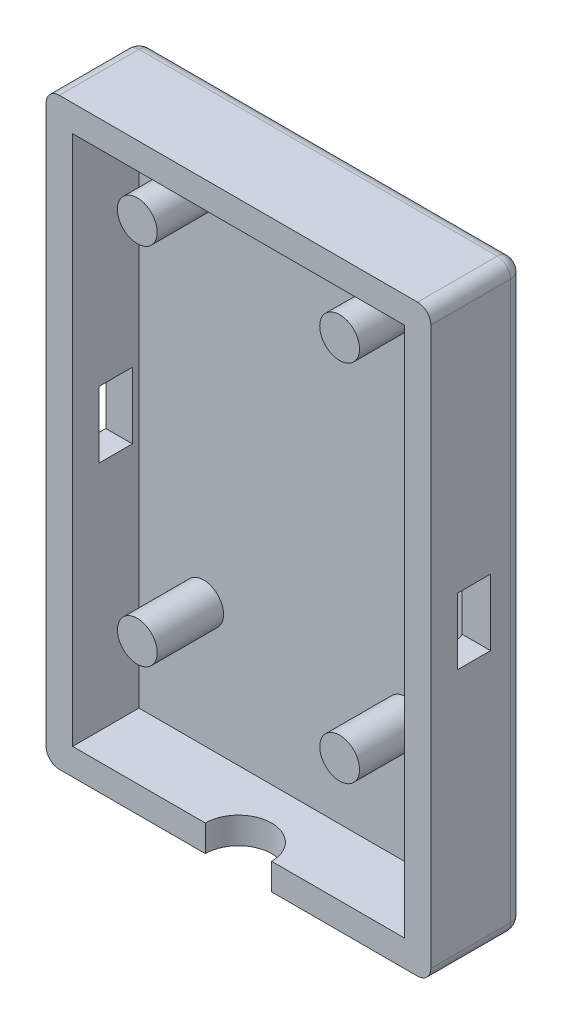
ISO-10303-21;
HEADER;
FILE_DESCRIPTION(('STEP AP214'),'2;1');
FILE_NAME('part.step','',(''),(''),'','','');
FILE_SCHEMA(('AUTOMOTIVE_DESIGN { 1 0 10303 214 1 1 1 1 }'));
ENDSEC;
DATA;
#1=APPLICATION_CONTEXT('core data for automotive mechanical design processes');
#2=APPLICATION_PROTOCOL_DEFINITION('international standard','automotive_design',2000,#1);
#3=PRODUCT_CONTEXT('',#1,'mechanical');
#4=PRODUCT('Part','Part','',(#3));
#5=PRODUCT_RELATED_PRODUCT_CATEGORY('part','',(#4));
#6=PRODUCT_DEFINITION_FORMATION('','',#4);
#7=PRODUCT_DEFINITION_CONTEXT('part definition',#1,'design');
#8=PRODUCT_DEFINITION('design','',#6,#7);
#9=PRODUCT_DEFINITION_SHAPE('','',#8);
#10=(LENGTH_UNIT() NAMED_UNIT(*) SI_UNIT(.MILLI.,.METRE.));
#11=(NAMED_UNIT(*) PLANE_ANGLE_UNIT() SI_UNIT($,.RADIAN.));
#12=(NAMED_UNIT(*) SI_UNIT($,.STERADIAN.) SOLID_ANGLE_UNIT());
#13=UNCERTAINTY_MEASURE_WITH_UNIT(LENGTH_MEASURE(1.E-05),#10,'distance_accuracy_value','');
#14=(GEOMETRIC_REPRESENTATION_CONTEXT(3) GLOBAL_UNCERTAINTY_ASSIGNED_CONTEXT((#13)) GLOBAL_UNIT_ASSIGNED_CONTEXT((#10,
#11,#12)) REPRESENTATION_CONTEXT('',''));
#15=CARTESIAN_POINT('',(0.,0.,0.));
#16=DIRECTION('',(0.,0.,1.));
#17=DIRECTION('',(1.,0.,0.));
#18=AXIS2_PLACEMENT_3D('',#15,#16,#17);
#19=CARTESIAN_POINT('',(14.5,25.025,2.));
#20=DIRECTION('',(-1.,0.,0.));
#21=DIRECTION('',(0.,-1.,0.));
#22=AXIS2_PLACEMENT_3D('',#19,#20,#21);
#23=PLANE('',#22);
#24=DIRECTION('',(0.,-1.,0.));
#25=VECTOR('',#24,1.);
#26=CARTESIAN_POINT('',(14.5,5.525,2.5));
#27=LINE('',#26,#25);
#28=CARTESIAN_POINT('',(14.5,5.525,2.5));
#29=VERTEX_POINT('',#28);
#30=CARTESIAN_POINT('',(14.5,0.525000000000001,2.5));
#31=VERTEX_POINT('',#30);
#32=EDGE_CURVE('E245',#29,#31,#27,.T.);
#33=ORIENTED_EDGE('',*,*,#32,.T.);
#34=DIRECTION('',(0.,0.,1.));
#35=VECTOR('',#34,1.);
#36=CARTESIAN_POINT('',(14.5,0.525000000000001,5.));
#37=LINE('',#36,#35);
#38=CARTESIAN_POINT('',(14.5,0.525000000000001,5.));
#39=VERTEX_POINT('',#38);
#40=EDGE_CURVE('E222',#31,#39,#37,.T.);
#41=ORIENTED_EDGE('',*,*,#40,.T.);
#42=DIRECTION('',(0.,1.,0.));
#43=VECTOR('',#42,1.);
#44=CARTESIAN_POINT('',(14.5,5.525,5.));
#45=LINE('',#44,#43);
#46=CARTESIAN_POINT('',(14.5,5.525,5.));
#47=VERTEX_POINT('',#46);
#48=EDGE_CURVE('E234',#39,#47,#45,.T.);
#49=ORIENTED_EDGE('',*,*,#48,.T.);
#50=DIRECTION('',(0.,0.,-1.));
#51=VECTOR('',#50,1.);
#52=CARTESIAN_POINT('',(14.5,5.525,4.5));
#53=LINE('',#52,#51);
#54=EDGE_CURVE('E241',#47,#29,#53,.T.);
#55=ORIENTED_EDGE('',*,*,#54,.T.);
#56=EDGE_LOOP('',(#33,#41,#49,#55));
#57=FACE_BOUND('',#56,.T.);
#58=DIRECTION('',(0.,1.,0.));
#59=VECTOR('',#58,1.);
#60=CARTESIAN_POINT('',(14.5,0.,7.));
#61=LINE('',#60,#59);
#62=CARTESIAN_POINT('',(14.5,-17.975,7.));
#63=VERTEX_POINT('',#62);
#64=CARTESIAN_POINT('',(14.5,24.025,7.));
#65=VERTEX_POINT('',#64);
#66=EDGE_CURVE('E306',#63,#65,#61,.T.);
#67=ORIENTED_EDGE('',*,*,#66,.F.);
#68=DIRECTION('',(0.,0.,-1.));
#69=VECTOR('',#68,1.);
#70=CARTESIAN_POINT('',(14.5,-17.975,2.));
#71=LINE('',#70,#69);
#72=CARTESIAN_POINT('',(14.5,-17.975,1.));
#73=VERTEX_POINT('',#72);
#74=EDGE_CURVE('E382',#63,#73,#71,.T.);
#75=ORIENTED_EDGE('',*,*,#74,.T.);
#76=DIRECTION('',(0.,1.,0.));
#77=VECTOR('',#76,1.);
#78=CARTESIAN_POINT('',(14.5,25.025,1.));
#79=LINE('',#78,#77);
#80=CARTESIAN_POINT('',(14.5,24.025,1.));
#81=VERTEX_POINT('',#80);
#82=EDGE_CURVE('E378',#73,#81,#79,.T.);
#83=ORIENTED_EDGE('',*,*,#82,.T.);
#84=DIRECTION('',(0.,0.,-1.));
#85=VECTOR('',#84,1.);
#86=CARTESIAN_POINT('',(14.5,24.025,2.));
#87=LINE('',#86,#85);
#88=EDGE_CURVE('E375',#81,#65,#87,.F.);
#89=ORIENTED_EDGE('',*,*,#88,.T.);
#90=EDGE_LOOP('',(#67,#75,#83,#89));
#91=FACE_BOUND('',#90,.T.);
#92=ADVANCED_FACE('F45',(#57,#91),#23,.F.);
#93=CARTESIAN_POINT('',(-14.5,25.025,2.));
#94=DIRECTION('',(0.,-1.,0.));
#95=DIRECTION('',(0.,0.,-1.));
#96=AXIS2_PLACEMENT_3D('',#93,#94,#95);
#97=PLANE('',#96);
#98=DIRECTION('',(-1.,0.,0.));
#99=VECTOR('',#98,1.);
#100=CARTESIAN_POINT('',(-14.5,25.025,1.));
#101=LINE('',#100,#99);
#102=CARTESIAN_POINT('',(13.5,25.025,1.));
#103=VERTEX_POINT('',#102);
#104=CARTESIAN_POINT('',(-13.5,25.025,1.));
#105=VERTEX_POINT('',#104);
#106=EDGE_CURVE('E428',#103,#105,#101,.T.);
#107=ORIENTED_EDGE('',*,*,#106,.T.);
#108=DIRECTION('',(0.,0.,-1.));
#109=VECTOR('',#108,1.);
#110=CARTESIAN_POINT('',(-13.5,25.025,2.));
#111=LINE('',#110,#109);
#112=CARTESIAN_POINT('',(-13.5,25.025,7.));
#113=VERTEX_POINT('',#112);
#114=EDGE_CURVE('E434',#105,#113,#111,.F.);
#115=ORIENTED_EDGE('',*,*,#114,.T.);
#116=DIRECTION('',(-1.,0.,0.));
#117=VECTOR('',#116,1.);
#118=CARTESIAN_POINT('',(0.,25.025,7.));
#119=LINE('',#118,#117);
#120=CARTESIAN_POINT('',(13.5,25.025,7.));
#121=VERTEX_POINT('',#120);
#122=EDGE_CURVE('E311',#121,#113,#119,.T.);
#123=ORIENTED_EDGE('',*,*,#122,.F.);
#124=DIRECTION('',(0.,0.,-1.));
#125=VECTOR('',#124,1.);
#126=CARTESIAN_POINT('',(13.5,25.025,2.));
#127=LINE('',#126,#125);
#128=EDGE_CURVE('E431',#121,#103,#127,.T.);
#129=ORIENTED_EDGE('',*,*,#128,.T.);
#130=EDGE_LOOP('',(#107,#115,#123,#129));
#131=FACE_BOUND('',#130,.T.);
#132=ADVANCED_FACE('F624',(#131),#97,.F.);
#133=CARTESIAN_POINT('',(-14.5,25.025,2.));
#134=DIRECTION('',(1.,0.,0.));
#135=DIRECTION('',(0.,1.,0.));
#136=AXIS2_PLACEMENT_3D('',#133,#134,#135);
#137=PLANE('',#136);
#138=DIRECTION('',(0.,1.,0.));
#139=VECTOR('',#138,1.);
#140=CARTESIAN_POINT('',(-14.5,5.525,5.));
#141=LINE('',#140,#139);
#142=CARTESIAN_POINT('',(-14.5,0.524999999999998,5.));
#143=VERTEX_POINT('',#142);
#144=CARTESIAN_POINT('',(-14.5,5.525,5.));
#145=VERTEX_POINT('',#144);
#146=EDGE_CURVE('E260',#143,#145,#141,.T.);
#147=ORIENTED_EDGE('',*,*,#146,.F.);
#148=DIRECTION('',(0.,0.,1.));
#149=VECTOR('',#148,1.);
#150=CARTESIAN_POINT('',(-14.5,0.524999999999998,4.5));
#151=LINE('',#150,#149);
#152=CARTESIAN_POINT('',(-14.5,0.524999999999997,2.5));
#153=VERTEX_POINT('',#152);
#154=EDGE_CURVE('E247',#153,#143,#151,.T.);
#155=ORIENTED_EDGE('',*,*,#154,.F.);
#156=DIRECTION('',(0.,-1.,0.));
#157=VECTOR('',#156,1.);
#158=CARTESIAN_POINT('',(-14.5,5.525,2.5));
#159=LINE('',#158,#157);
#160=CARTESIAN_POINT('',(-14.5,5.525,2.5));
#161=VERTEX_POINT('',#160);
#162=EDGE_CURVE('E250',#161,#153,#159,.T.);
#163=ORIENTED_EDGE('',*,*,#162,.F.);
#164=DIRECTION('',(0.,0.,-1.));
#165=VECTOR('',#164,1.);
#166=CARTESIAN_POINT('',(-14.5,5.525,4.5));
#167=LINE('',#166,#165);
#168=EDGE_CURVE('E264',#145,#161,#167,.T.);
#169=ORIENTED_EDGE('',*,*,#168,.F.);
#170=EDGE_LOOP('',(#147,#155,#163,#169));
#171=FACE_BOUND('',#170,.T.);
#172=DIRECTION('',(0.,-1.,0.));
#173=VECTOR('',#172,1.);
#174=CARTESIAN_POINT('',(-14.5,25.025,1.));
#175=LINE('',#174,#173);
#176=CARTESIAN_POINT('',(-14.5,24.025,1.));
#177=VERTEX_POINT('',#176);
#178=CARTESIAN_POINT('',(-14.5,-17.975,1.));
#179=VERTEX_POINT('',#178);
#180=EDGE_CURVE('E419',#177,#179,#175,.T.);
#181=ORIENTED_EDGE('',*,*,#180,.T.);
#182=DIRECTION('',(0.,0.,-1.));
#183=VECTOR('',#182,1.);
#184=CARTESIAN_POINT('',(-14.5,-17.975,2.));
#185=LINE('',#184,#183);
#186=CARTESIAN_POINT('',(-14.5,-17.975,7.));
#187=VERTEX_POINT('',#186);
#188=EDGE_CURVE('E425',#179,#187,#185,.F.);
#189=ORIENTED_EDGE('',*,*,#188,.T.);
#190=DIRECTION('',(0.,-1.,0.));
#191=VECTOR('',#190,1.);
#192=CARTESIAN_POINT('',(-14.5,0.,7.));
#193=LINE('',#192,#191);
#194=CARTESIAN_POINT('',(-14.5,24.025,7.));
#195=VERTEX_POINT('',#194);
#196=EDGE_CURVE('E315',#195,#187,#193,.T.);
#197=ORIENTED_EDGE('',*,*,#196,.F.);
#198=DIRECTION('',(0.,0.,-1.));
#199=VECTOR('',#198,1.);
#200=CARTESIAN_POINT('',(-14.5,24.025,2.));
#201=LINE('',#200,#199);
#202=EDGE_CURVE('E422',#195,#177,#201,.T.);
#203=ORIENTED_EDGE('',*,*,#202,.T.);
#204=EDGE_LOOP('',(#181,#189,#197,#203));
#205=FACE_BOUND('',#204,.T.);
#206=ADVANCED_FACE('F599',(#171,#205),#137,.F.);
#207=CARTESIAN_POINT('',(-14.5,-18.975,2.));
#208=DIRECTION('',(0.,1.,0.));
#209=DIRECTION('',(0.,0.,1.));
#210=AXIS2_PLACEMENT_3D('',#207,#208,#209);
#211=PLANE('',#210);
#212=DIRECTION('',(1.,0.,0.));
#213=VECTOR('',#212,1.);
#214=CARTESIAN_POINT('',(-14.5,-18.975,1.));
#215=LINE('',#214,#213);
#216=CARTESIAN_POINT('',(-13.5,-18.975,1.));
#217=VERTEX_POINT('',#216);
#218=CARTESIAN_POINT('',(13.5,-18.975,1.));
#219=VERTEX_POINT('',#218);
#220=EDGE_CURVE('E401',#217,#219,#215,.T.);
#221=ORIENTED_EDGE('',*,*,#220,.T.);
#222=DIRECTION('',(0.,0.,-1.));
#223=VECTOR('',#222,1.);
#224=CARTESIAN_POINT('',(13.5,-18.975,2.));
#225=LINE('',#224,#223);
#226=CARTESIAN_POINT('',(13.5,-18.975,7.));
#227=VERTEX_POINT('',#226);
#228=EDGE_CURVE('E404',#219,#227,#225,.F.);
#229=ORIENTED_EDGE('',*,*,#228,.T.);
#230=DIRECTION('',(1.,0.,0.));
#231=VECTOR('',#230,1.);
#232=CARTESIAN_POINT('',(0.,-18.975,7.));
#233=LINE('',#232,#231);
#234=CARTESIAN_POINT('',(2.5,-18.975,7.));
#235=VERTEX_POINT('',#234);
#236=EDGE_CURVE('E307',#235,#227,#233,.T.);
#237=ORIENTED_EDGE('',*,*,#236,.F.);
#238=CARTESIAN_POINT('',(0.,-18.975,7.));
#239=DIRECTION('',(0.,1.,0.));
#240=DIRECTION('',(0.,0.,1.));
#241=AXIS2_PLACEMENT_3D('',#238,#239,#240);
#242=CIRCLE('',#241,2.5);
#243=CARTESIAN_POINT('',(-2.5,-18.975,7.));
#244=VERTEX_POINT('',#243);
#245=EDGE_CURVE('E289',#235,#244,#242,.T.);
#246=ORIENTED_EDGE('',*,*,#245,.T.);
#247=CARTESIAN_POINT('',(-13.5,-18.975,7.));
#248=VERTEX_POINT('',#247);
#249=EDGE_CURVE('E303',#248,#244,#233,.T.);
#250=ORIENTED_EDGE('',*,*,#249,.F.);
#251=DIRECTION('',(0.,0.,-1.));
#252=VECTOR('',#251,1.);
#253=CARTESIAN_POINT('',(-13.5,-18.975,2.));
#254=LINE('',#253,#252);
#255=EDGE_CURVE('E398',#248,#217,#254,.T.);
#256=ORIENTED_EDGE('',*,*,#255,.T.);
#257=EDGE_LOOP('',(#221,#229,#237,#246,#250,#256));
#258=FACE_BOUND('',#257,.T.);
#259=ADVANCED_FACE('F579',(#258),#211,.F.);
#260=CARTESIAN_POINT('',(0.,0.,0.));
#261=DIRECTION('',(0.,0.,1.));
#262=DIRECTION('',(1.,0.,0.));
#263=AXIS2_PLACEMENT_3D('',#260,#261,#262);
#264=PLANE('',#263);
#265=DIRECTION('',(-1.,0.,0.));
#266=VECTOR('',#265,1.);
#267=CARTESIAN_POINT('',(0.,24.025,0.));
#268=LINE('',#267,#266);
#269=CARTESIAN_POINT('',(-13.5,24.025,0.));
#270=VERTEX_POINT('',#269);
#271=CARTESIAN_POINT('',(13.5,24.025,0.));
#272=VERTEX_POINT('',#271);
#273=EDGE_CURVE('E388',#270,#272,#268,.F.);
#274=ORIENTED_EDGE('',*,*,#273,.T.);
#275=DIRECTION('',(0.,1.,0.));
#276=VECTOR('',#275,1.);
#277=CARTESIAN_POINT('',(13.5,0.,0.));
#278=LINE('',#277,#276);
#279=CARTESIAN_POINT('',(13.5,-17.975,0.));
#280=VERTEX_POINT('',#279);
#281=EDGE_CURVE('E394',#272,#280,#278,.F.);
#282=ORIENTED_EDGE('',*,*,#281,.T.);
#283=DIRECTION('',(1.,0.,0.));
#284=VECTOR('',#283,1.);
#285=CARTESIAN_POINT('',(0.,-17.975,0.));
#286=LINE('',#285,#284);
#287=CARTESIAN_POINT('',(-13.5,-17.975,0.));
#288=VERTEX_POINT('',#287);
#289=EDGE_CURVE('E391',#280,#288,#286,.F.);
#290=ORIENTED_EDGE('',*,*,#289,.T.);
#291=DIRECTION('',(0.,-1.,0.));
#292=VECTOR('',#291,1.);
#293=CARTESIAN_POINT('',(-13.5,0.,0.));
#294=LINE('',#293,#292);
#295=EDGE_CURVE('E385',#288,#270,#294,.F.);
#296=ORIENTED_EDGE('',*,*,#295,.T.);
#297=EDGE_LOOP('',(#274,#282,#290,#296));
#298=FACE_BOUND('',#297,.T.);
#299=ADVANCED_FACE('F698',(#298),#264,.F.);
#300=CARTESIAN_POINT('',(0.,23.025,7.));
#301=DIRECTION('',(0.,1.,0.));
#302=DIRECTION('',(0.,0.,1.));
#303=AXIS2_PLACEMENT_3D('',#300,#301,#302);
#304=PLANE('',#303);
#305=DIRECTION('',(1.,0.,0.));
#306=VECTOR('',#305,1.);
#307=CARTESIAN_POINT('',(0.,23.025,2.));
#308=LINE('',#307,#306);
#309=CARTESIAN_POINT('',(-12.5,23.025,2.));
#310=VERTEX_POINT('',#309);
#311=CARTESIAN_POINT('',(11.5,23.025,2.));
#312=VERTEX_POINT('',#311);
#313=EDGE_CURVE('E299',#310,#312,#308,.T.);
#314=ORIENTED_EDGE('',*,*,#313,.T.);
#315=CARTESIAN_POINT('',(11.5,23.025,3.));
#316=DIRECTION('',(0.,1.,0.));
#317=DIRECTION('',(0.,0.,1.));
#318=AXIS2_PLACEMENT_3D('',#315,#316,#317);
#319=CIRCLE('',#318,1.);
#320=CARTESIAN_POINT('',(12.5,23.025,3.));
#321=VERTEX_POINT('',#320);
#322=EDGE_CURVE('E450',#312,#321,#319,.F.);
#323=ORIENTED_EDGE('',*,*,#322,.T.);
#324=DIRECTION('',(0.,0.,-1.));
#325=VECTOR('',#324,1.);
#326=CARTESIAN_POINT('',(12.5,23.025,7.));
#327=LINE('',#326,#325);
#328=CARTESIAN_POINT('',(12.5,23.025,7.));
#329=VERTEX_POINT('',#328);
#330=EDGE_CURVE('E358',#329,#321,#327,.T.);
#331=ORIENTED_EDGE('',*,*,#330,.F.);
#332=DIRECTION('',(1.,0.,0.));
#333=VECTOR('',#332,1.);
#334=CARTESIAN_POINT('',(0.,23.025,7.));
#335=LINE('',#334,#333);
#336=CARTESIAN_POINT('',(-12.5,23.025,7.));
#337=VERTEX_POINT('',#336);
#338=EDGE_CURVE('E319',#337,#329,#335,.T.);
#339=ORIENTED_EDGE('',*,*,#338,.F.);
#340=DIRECTION('',(0.,0.,-1.));
#341=VECTOR('',#340,1.);
#342=CARTESIAN_POINT('',(-12.5,23.025,7.));
#343=LINE('',#342,#341);
#344=EDGE_CURVE('E336',#337,#310,#343,.T.);
#345=ORIENTED_EDGE('',*,*,#344,.T.);
#346=EDGE_LOOP('',(#314,#323,#331,#339,#345));
#347=FACE_BOUND('',#346,.T.);
#348=ADVANCED_FACE('F558',(#347),#304,.F.);
#349=CARTESIAN_POINT('',(12.5,0.,7.));
#350=DIRECTION('',(1.,0.,0.));
#351=DIRECTION('',(0.,0.,-1.));
#352=AXIS2_PLACEMENT_3D('',#349,#350,#351);
#353=PLANE('',#352);
#354=ORIENTED_EDGE('',*,*,#330,.T.);
#355=DIRECTION('',(0.,-1.,0.));
#356=VECTOR('',#355,1.);
#357=CARTESIAN_POINT('',(12.5,0.,3.));
#358=LINE('',#357,#356);
#359=CARTESIAN_POINT('',(12.5,5.525,3.));
#360=VERTEX_POINT('',#359);
#361=EDGE_CURVE('E440',#321,#360,#358,.T.);
#362=ORIENTED_EDGE('',*,*,#361,.T.);
#363=DIRECTION('',(0.,0.,1.));
#364=VECTOR('',#363,1.);
#365=CARTESIAN_POINT('',(12.5,5.525,7.));
#366=LINE('',#365,#364);
#367=CARTESIAN_POINT('',(12.5,5.525,5.));
#368=VERTEX_POINT('',#367);
#369=EDGE_CURVE('E283',#360,#368,#366,.T.);
#370=ORIENTED_EDGE('',*,*,#369,.T.);
#371=DIRECTION('',(0.,-1.,0.));
#372=VECTOR('',#371,1.);
#373=CARTESIAN_POINT('',(12.5,0.,5.));
#374=LINE('',#373,#372);
#375=CARTESIAN_POINT('',(12.5,0.524999999999998,5.));
#376=VERTEX_POINT('',#375);
#377=EDGE_CURVE('E274',#368,#376,#374,.T.);
#378=ORIENTED_EDGE('',*,*,#377,.T.);
#379=DIRECTION('',(0.,0.,-1.));
#380=VECTOR('',#379,1.);
#381=CARTESIAN_POINT('',(12.5,0.525000000000001,7.));
#382=LINE('',#381,#380);
#383=CARTESIAN_POINT('',(12.5,0.525000000000001,3.));
#384=VERTEX_POINT('',#383);
#385=EDGE_CURVE('E224',#376,#384,#382,.T.);
#386=ORIENTED_EDGE('',*,*,#385,.T.);
#387=DIRECTION('',(0.,-1.,0.));
#388=VECTOR('',#387,1.);
#389=CARTESIAN_POINT('',(12.5,0.,3.));
#390=LINE('',#389,#388);
#391=CARTESIAN_POINT('',(12.5,-16.975,3.));
#392=VERTEX_POINT('',#391);
#393=EDGE_CURVE('E437',#384,#392,#390,.T.);
#394=ORIENTED_EDGE('',*,*,#393,.T.);
#395=DIRECTION('',(0.,0.,-1.));
#396=VECTOR('',#395,1.);
#397=CARTESIAN_POINT('',(12.5,-16.975,7.));
#398=LINE('',#397,#396);
#399=CARTESIAN_POINT('',(12.5,-16.975,7.));
#400=VERTEX_POINT('',#399);
#401=EDGE_CURVE('E354',#400,#392,#398,.T.);
#402=ORIENTED_EDGE('',*,*,#401,.F.);
#403=DIRECTION('',(0.,-1.,0.));
#404=VECTOR('',#403,1.);
#405=CARTESIAN_POINT('',(12.5,0.,7.));
#406=LINE('',#405,#404);
#407=EDGE_CURVE('E323',#329,#400,#406,.T.);
#408=ORIENTED_EDGE('',*,*,#407,.F.);
#409=EDGE_LOOP('',(#354,#362,#370,#378,#386,#394,#402,#408));
#410=FACE_BOUND('',#409,.T.);
#411=ADVANCED_FACE('F561',(#410),#353,.F.);
#412=CARTESIAN_POINT('',(0.,-16.975,7.));
#413=DIRECTION('',(0.,1.,0.));
#414=DIRECTION('',(-1.,0.,0.));
#415=AXIS2_PLACEMENT_3D('',#412,#413,#414);
#416=PLANE('',#415);
#417=ORIENTED_EDGE('',*,*,#401,.T.);
#418=CARTESIAN_POINT('',(11.5,-16.975,3.));
#419=DIRECTION('',(0.,1.,0.));
#420=DIRECTION('',(-1.,0.,0.));
#421=AXIS2_PLACEMENT_3D('',#418,#419,#420);
#422=CIRCLE('',#421,1.);
#423=CARTESIAN_POINT('',(11.5,-16.975,2.));
#424=VERTEX_POINT('',#423);
#425=EDGE_CURVE('E444',#392,#424,#422,.T.);
#426=ORIENTED_EDGE('',*,*,#425,.T.);
#427=DIRECTION('',(1.,0.,0.));
#428=VECTOR('',#427,1.);
#429=CARTESIAN_POINT('',(0.,-16.975,2.));
#430=LINE('',#429,#428);
#431=CARTESIAN_POINT('',(-12.5,-16.975,2.));
#432=VERTEX_POINT('',#431);
#433=EDGE_CURVE('E340',#432,#424,#430,.T.);
#434=ORIENTED_EDGE('',*,*,#433,.F.);
#435=DIRECTION('',(0.,0.,-1.));
#436=VECTOR('',#435,1.);
#437=CARTESIAN_POINT('',(-12.5,-16.975,7.));
#438=LINE('',#437,#436);
#439=CARTESIAN_POINT('',(-12.5,-16.975,7.));
#440=VERTEX_POINT('',#439);
#441=EDGE_CURVE('E350',#440,#432,#438,.T.);
#442=ORIENTED_EDGE('',*,*,#441,.F.);
#443=DIRECTION('',(1.,0.,0.));
#444=VECTOR('',#443,1.);
#445=CARTESIAN_POINT('',(0.,-16.975,7.));
#446=LINE('',#445,#444);
#447=CARTESIAN_POINT('',(-2.5,-16.975,7.));
#448=VERTEX_POINT('',#447);
#449=EDGE_CURVE('E328',#440,#448,#446,.T.);
#450=ORIENTED_EDGE('',*,*,#449,.T.);
#451=CARTESIAN_POINT('',(0.,-16.975,7.));
#452=DIRECTION('',(0.,1.,0.));
#453=DIRECTION('',(0.,0.,1.));
#454=AXIS2_PLACEMENT_3D('',#451,#452,#453);
#455=CIRCLE('',#454,2.5);
#456=CARTESIAN_POINT('',(2.5,-16.975,7.));
#457=VERTEX_POINT('',#456);
#458=EDGE_CURVE('E288',#457,#448,#455,.T.);
#459=ORIENTED_EDGE('',*,*,#458,.F.);
#460=EDGE_CURVE('E327',#457,#400,#446,.T.);
#461=ORIENTED_EDGE('',*,*,#460,.T.);
#462=EDGE_LOOP('',(#417,#426,#434,#442,#450,#459,#461));
#463=FACE_BOUND('',#462,.T.);
#464=ADVANCED_FACE('F571',(#463),#416,.T.);
#465=CARTESIAN_POINT('',(-12.5,0.,7.));
#466=DIRECTION('',(1.,0.,0.));
#467=DIRECTION('',(0.,1.,0.));
#468=AXIS2_PLACEMENT_3D('',#465,#466,#467);
#469=PLANE('',#468);
#470=DIRECTION('',(0.,0.,-1.));
#471=VECTOR('',#470,1.);
#472=CARTESIAN_POINT('',(-12.5,0.524999999999998,7.));
#473=LINE('',#472,#471);
#474=CARTESIAN_POINT('',(-12.5,0.524999999999998,5.));
#475=VERTEX_POINT('',#474);
#476=CARTESIAN_POINT('',(-12.5,0.524999999999998,2.5));
#477=VERTEX_POINT('',#476);
#478=EDGE_CURVE('E372',#475,#477,#473,.T.);
#479=ORIENTED_EDGE('',*,*,#478,.F.);
#480=DIRECTION('',(0.,-1.,0.));
#481=VECTOR('',#480,1.);
#482=CARTESIAN_POINT('',(-12.5,0.,5.));
#483=LINE('',#482,#481);
#484=CARTESIAN_POINT('',(-12.5,5.525,5.));
#485=VERTEX_POINT('',#484);
#486=EDGE_CURVE('E362',#485,#475,#483,.T.);
#487=ORIENTED_EDGE('',*,*,#486,.F.);
#488=DIRECTION('',(0.,0.,1.));
#489=VECTOR('',#488,1.);
#490=CARTESIAN_POINT('',(-12.5,5.525,7.));
#491=LINE('',#490,#489);
#492=CARTESIAN_POINT('',(-12.5,5.525,2.5));
#493=VERTEX_POINT('',#492);
#494=EDGE_CURVE('E365',#493,#485,#491,.T.);
#495=ORIENTED_EDGE('',*,*,#494,.F.);
#496=DIRECTION('',(0.,1.,0.));
#497=VECTOR('',#496,1.);
#498=CARTESIAN_POINT('',(-12.5,0.,2.5));
#499=LINE('',#498,#497);
#500=EDGE_CURVE('E369',#477,#493,#499,.T.);
#501=ORIENTED_EDGE('',*,*,#500,.F.);
#502=EDGE_LOOP('',(#479,#487,#495,#501));
#503=FACE_BOUND('',#502,.T.);
#504=DIRECTION('',(0.,-1.,0.));
#505=VECTOR('',#504,1.);
#506=CARTESIAN_POINT('',(-12.5,0.,2.));
#507=LINE('',#506,#505);
#508=EDGE_CURVE('E344',#310,#432,#507,.T.);
#509=ORIENTED_EDGE('',*,*,#508,.F.);
#510=ORIENTED_EDGE('',*,*,#344,.F.);
#511=DIRECTION('',(0.,-1.,0.));
#512=VECTOR('',#511,1.);
#513=CARTESIAN_POINT('',(-12.5,0.,7.));
#514=LINE('',#513,#512);
#515=EDGE_CURVE('E332',#337,#440,#514,.T.);
#516=ORIENTED_EDGE('',*,*,#515,.T.);
#517=ORIENTED_EDGE('',*,*,#441,.T.);
#518=EDGE_LOOP('',(#509,#510,#516,#517));
#519=FACE_BOUND('',#518,.T.);
#520=ADVANCED_FACE('F570',(#503,#519),#469,.T.);
#521=CARTESIAN_POINT('',(0.,0.,7.));
#522=DIRECTION('',(0.,0.,1.));
#523=DIRECTION('',(1.,0.,0.));
#524=AXIS2_PLACEMENT_3D('',#521,#522,#523);
#525=PLANE('',#524);
#526=ORIENTED_EDGE('',*,*,#236,.T.);
#527=CARTESIAN_POINT('',(13.5,-17.975,7.));
#528=DIRECTION('',(0.,0.,1.));
#529=DIRECTION('',(1.,0.,0.));
#530=AXIS2_PLACEMENT_3D('',#527,#528,#529);
#531=CIRCLE('',#530,1.);
#532=EDGE_CURVE('E416',#227,#63,#531,.T.);
#533=ORIENTED_EDGE('',*,*,#532,.T.);
#534=ORIENTED_EDGE('',*,*,#66,.T.);
#535=CARTESIAN_POINT('',(13.5,24.025,7.));
#536=DIRECTION('',(0.,0.,1.));
#537=DIRECTION('',(1.,0.,0.));
#538=AXIS2_PLACEMENT_3D('',#535,#536,#537);
#539=CIRCLE('',#538,1.);
#540=EDGE_CURVE('E407',#65,#121,#539,.T.);
#541=ORIENTED_EDGE('',*,*,#540,.T.);
#542=ORIENTED_EDGE('',*,*,#122,.T.);
#543=CARTESIAN_POINT('',(-13.5,24.025,7.));
#544=DIRECTION('',(0.,0.,1.));
#545=DIRECTION('',(1.,0.,0.));
#546=AXIS2_PLACEMENT_3D('',#543,#544,#545);
#547=CIRCLE('',#546,1.);
#548=EDGE_CURVE('E410',#113,#195,#547,.T.);
#549=ORIENTED_EDGE('',*,*,#548,.T.);
#550=ORIENTED_EDGE('',*,*,#196,.T.);
#551=CARTESIAN_POINT('',(-13.5,-17.975,7.));
#552=DIRECTION('',(0.,0.,1.));
#553=DIRECTION('',(1.,0.,0.));
#554=AXIS2_PLACEMENT_3D('',#551,#552,#553);
#555=CIRCLE('',#554,1.);
#556=EDGE_CURVE('E413',#187,#248,#555,.T.);
#557=ORIENTED_EDGE('',*,*,#556,.T.);
#558=ORIENTED_EDGE('',*,*,#249,.T.);
#559=DIRECTION('',(0.,1.,0.));
#560=VECTOR('',#559,1.);
#561=CARTESIAN_POINT('',(-2.5,-18.975,7.));
#562=LINE('',#561,#560);
#563=EDGE_CURVE('E293',#244,#448,#562,.T.);
#564=ORIENTED_EDGE('',*,*,#563,.T.);
#565=ORIENTED_EDGE('',*,*,#449,.F.);
#566=ORIENTED_EDGE('',*,*,#515,.F.);
#567=ORIENTED_EDGE('',*,*,#338,.T.);
#568=ORIENTED_EDGE('',*,*,#407,.T.);
#569=ORIENTED_EDGE('',*,*,#460,.F.);
#570=DIRECTION('',(0.,1.,0.));
#571=VECTOR('',#570,1.);
#572=CARTESIAN_POINT('',(2.5,-18.975,7.));
#573=LINE('',#572,#571);
#574=EDGE_CURVE('E296',#235,#457,#573,.T.);
#575=ORIENTED_EDGE('',*,*,#574,.F.);
#576=EDGE_LOOP('',(#526,#533,#534,#541,#542,#549,#550,#557,#558,#564,#565,#566,#567,#568,#569,#575));
#577=FACE_BOUND('',#576,.T.);
#578=ADVANCED_FACE('F544',(#577),#525,.T.);
#579=CARTESIAN_POINT('',(0.,0.,2.));
#580=DIRECTION('',(0.,0.,1.));
#581=DIRECTION('',(1.,0.,0.));
#582=AXIS2_PLACEMENT_3D('',#579,#580,#581);
#583=PLANE('',#582);
#584=CARTESIAN_POINT('',(7.625,19.775,2.));
#585=DIRECTION('',(0.,0.,1.));
#586=DIRECTION('',(-1.,0.,0.));
#587=AXIS2_PLACEMENT_3D('',#584,#585,#586);
#588=CIRCLE('',#587,1.5);
#589=CARTESIAN_POINT('',(6.125,19.775,2.));
#590=VERTEX_POINT('',#589);
#591=EDGE_CURVE('E507',#590,#590,#588,.T.);
#592=ORIENTED_EDGE('',*,*,#591,.F.);
#593=EDGE_LOOP('',(#592));
#594=FACE_BOUND('',#593,.T.);
#595=CARTESIAN_POINT('',(7.625,-7.675,2.));
#596=DIRECTION('',(0.,0.,1.));
#597=DIRECTION('',(1.,0.,0.));
#598=AXIS2_PLACEMENT_3D('',#595,#596,#597);
#599=CIRCLE('',#598,1.5);
#600=CARTESIAN_POINT('',(9.125,-7.675,2.));
#601=VERTEX_POINT('',#600);
#602=EDGE_CURVE('E516',#601,#601,#599,.T.);
#603=ORIENTED_EDGE('',*,*,#602,.F.);
#604=EDGE_LOOP('',(#603));
#605=FACE_BOUND('',#604,.T.);
#606=CARTESIAN_POINT('',(-7.625,-7.675,2.));
#607=DIRECTION('',(0.,0.,1.));
#608=DIRECTION('',(-1.,0.,0.));
#609=AXIS2_PLACEMENT_3D('',#606,#607,#608);
#610=CIRCLE('',#609,1.5);
#611=CARTESIAN_POINT('',(-9.125,-7.675,2.));
#612=VERTEX_POINT('',#611);
#613=EDGE_CURVE('E524',#612,#612,#610,.T.);
#614=ORIENTED_EDGE('',*,*,#613,.F.);
#615=EDGE_LOOP('',(#614));
#616=FACE_BOUND('',#615,.T.);
#617=CARTESIAN_POINT('',(-7.625,19.775,2.));
#618=DIRECTION('',(0.,0.,1.));
#619=DIRECTION('',(1.,0.,0.));
#620=AXIS2_PLACEMENT_3D('',#617,#618,#619);
#621=CIRCLE('',#620,1.5);
#622=CARTESIAN_POINT('',(-6.125,19.775,2.));
#623=VERTEX_POINT('',#622);
#624=EDGE_CURVE('E253',#623,#623,#621,.T.);
#625=ORIENTED_EDGE('',*,*,#624,.F.);
#626=EDGE_LOOP('',(#625));
#627=FACE_BOUND('',#626,.T.);
#628=ORIENTED_EDGE('',*,*,#433,.T.);
#629=DIRECTION('',(0.,-1.,0.));
#630=VECTOR('',#629,1.);
#631=CARTESIAN_POINT('',(11.5,0.,2.));
#632=LINE('',#631,#630);
#633=EDGE_CURVE('E447',#424,#312,#632,.F.);
#634=ORIENTED_EDGE('',*,*,#633,.T.);
#635=ORIENTED_EDGE('',*,*,#313,.F.);
#636=ORIENTED_EDGE('',*,*,#508,.T.);
#637=EDGE_LOOP('',(#628,#634,#635,#636));
#638=FACE_BOUND('',#637,.T.);
#639=ADVANCED_FACE('F540',(#594,#605,#616,#627,#638),#583,.T.);
#640=CARTESIAN_POINT('',(0.,-18.975,7.));
#641=DIRECTION('',(0.,1.,0.));
#642=DIRECTION('',(0.,0.,1.));
#643=AXIS2_PLACEMENT_3D('',#640,#641,#642);
#644=CYLINDRICAL_SURFACE('',#643,2.5);
#645=ORIENTED_EDGE('',*,*,#458,.T.);
#646=ORIENTED_EDGE('',*,*,#563,.F.);
#647=ORIENTED_EDGE('',*,*,#245,.F.);
#648=ORIENTED_EDGE('',*,*,#574,.T.);
#649=EDGE_LOOP('',(#645,#646,#647,#648));
#650=FACE_BOUND('',#649,.T.);
#651=ADVANCED_FACE('F543',(#650),#644,.F.);
#652=CARTESIAN_POINT('',(14.5,5.525,5.));
#653=DIRECTION('',(0.,0.,1.));
#654=DIRECTION('',(1.,0.,0.));
#655=AXIS2_PLACEMENT_3D('',#652,#653,#654);
#656=PLANE('',#655);
#657=ORIENTED_EDGE('',*,*,#486,.T.);
#658=DIRECTION('',(-1.,0.,0.));
#659=VECTOR('',#658,1.);
#660=CARTESIAN_POINT('',(14.5,0.525000000000001,5.));
#661=LINE('',#660,#659);
#662=EDGE_CURVE('E230',#475,#143,#661,.T.);
#663=ORIENTED_EDGE('',*,*,#662,.T.);
#664=ORIENTED_EDGE('',*,*,#146,.T.);
#665=DIRECTION('',(-1.,0.,0.));
#666=VECTOR('',#665,1.);
#667=CARTESIAN_POINT('',(14.5,5.525,5.));
#668=LINE('',#667,#666);
#669=EDGE_CURVE('E229',#485,#145,#668,.T.);
#670=ORIENTED_EDGE('',*,*,#669,.F.);
#671=EDGE_LOOP('',(#657,#663,#664,#670));
#672=FACE_BOUND('',#671,.T.);
#673=ADVANCED_FACE('F592',(#672),#656,.F.);
#674=CARTESIAN_POINT('',(14.5,5.525,4.5));
#675=DIRECTION('',(0.,1.,0.));
#676=DIRECTION('',(0.,0.,1.));
#677=AXIS2_PLACEMENT_3D('',#674,#675,#676);
#678=PLANE('',#677);
#679=ORIENTED_EDGE('',*,*,#494,.T.);
#680=ORIENTED_EDGE('',*,*,#669,.T.);
#681=ORIENTED_EDGE('',*,*,#168,.T.);
#682=DIRECTION('',(-1.,0.,0.));
#683=VECTOR('',#682,1.);
#684=CARTESIAN_POINT('',(14.5,5.525,2.5));
#685=LINE('',#684,#683);
#686=EDGE_CURVE('E278',#493,#161,#685,.T.);
#687=ORIENTED_EDGE('',*,*,#686,.F.);
#688=EDGE_LOOP('',(#679,#680,#681,#687));
#689=FACE_BOUND('',#688,.T.);
#690=ADVANCED_FACE('F604',(#689),#678,.F.);
#691=CARTESIAN_POINT('',(14.5,5.525,2.5));
#692=DIRECTION('',(0.,0.,-1.));
#693=DIRECTION('',(-1.,0.,0.));
#694=AXIS2_PLACEMENT_3D('',#691,#692,#693);
#695=PLANE('',#694);
#696=ORIENTED_EDGE('',*,*,#500,.T.);
#697=ORIENTED_EDGE('',*,*,#686,.T.);
#698=ORIENTED_EDGE('',*,*,#162,.T.);
#699=DIRECTION('',(-1.,0.,0.));
#700=VECTOR('',#699,1.);
#701=CARTESIAN_POINT('',(14.5,0.525000000000001,2.5));
#702=LINE('',#701,#700);
#703=EDGE_CURVE('E275',#477,#153,#702,.T.);
#704=ORIENTED_EDGE('',*,*,#703,.F.);
#705=EDGE_LOOP('',(#696,#697,#698,#704));
#706=FACE_BOUND('',#705,.T.);
#707=ADVANCED_FACE('F611',(#706),#695,.F.);
#708=CARTESIAN_POINT('',(14.5,0.525000000000001,4.5));
#709=DIRECTION('',(0.,-1.,0.));
#710=DIRECTION('',(1.,0.,0.));
#711=AXIS2_PLACEMENT_3D('',#708,#709,#710);
#712=PLANE('',#711);
#713=ORIENTED_EDGE('',*,*,#478,.T.);
#714=ORIENTED_EDGE('',*,*,#703,.T.);
#715=ORIENTED_EDGE('',*,*,#154,.T.);
#716=ORIENTED_EDGE('',*,*,#662,.F.);
#717=EDGE_LOOP('',(#713,#714,#715,#716));
#718=FACE_BOUND('',#717,.T.);
#719=ADVANCED_FACE('F609',(#718),#712,.F.);
#720=EDGE_CURVE('E218',#39,#376,#661,.T.);
#721=ORIENTED_EDGE('',*,*,#720,.F.);
#722=ORIENTED_EDGE('',*,*,#40,.F.);
#723=CARTESIAN_POINT('',(12.3660254037844,0.525000000000001,2.5));
#724=VERTEX_POINT('',#723);
#725=EDGE_CURVE('E62',#31,#724,#702,.T.);
#726=ORIENTED_EDGE('',*,*,#725,.T.);
#727=CARTESIAN_POINT('',(11.5,0.525000000000001,3.));
#728=DIRECTION('',(0.,-1.,0.));
#729=DIRECTION('',(1.,0.,0.));
#730=AXIS2_PLACEMENT_3D('',#727,#728,#729);
#731=CIRCLE('',#730,1.);
#732=EDGE_CURVE('E11',#724,#384,#731,.T.);
#733=ORIENTED_EDGE('',*,*,#732,.T.);
#734=ORIENTED_EDGE('',*,*,#385,.F.);
#735=EDGE_LOOP('',(#721,#722,#726,#733,#734));
#736=FACE_BOUND('',#735,.T.);
#737=ADVANCED_FACE('F220',(#736),#712,.F.);
#738=ORIENTED_EDGE('',*,*,#725,.F.);
#739=ORIENTED_EDGE('',*,*,#32,.F.);
#740=CARTESIAN_POINT('',(12.3660254037844,5.525,2.5));
#741=VERTEX_POINT('',#740);
#742=EDGE_CURVE('E69',#29,#741,#685,.T.);
#743=ORIENTED_EDGE('',*,*,#742,.T.);
#744=DIRECTION('',(0.,-1.,0.));
#745=VECTOR('',#744,1.);
#746=CARTESIAN_POINT('',(12.3660254037844,5.525,2.5));
#747=LINE('',#746,#745);
#748=EDGE_CURVE('E55',#741,#724,#747,.T.);
#749=ORIENTED_EDGE('',*,*,#748,.T.);
#750=EDGE_LOOP('',(#738,#739,#743,#749));
#751=FACE_BOUND('',#750,.T.);
#752=ADVANCED_FACE('F614',(#751),#695,.F.);
#753=ORIENTED_EDGE('',*,*,#742,.F.);
#754=ORIENTED_EDGE('',*,*,#54,.F.);
#755=EDGE_CURVE('E237',#47,#368,#668,.T.);
#756=ORIENTED_EDGE('',*,*,#755,.T.);
#757=ORIENTED_EDGE('',*,*,#369,.F.);
#758=CARTESIAN_POINT('',(11.5,5.525,3.));
#759=DIRECTION('',(0.,1.,0.));
#760=DIRECTION('',(0.,0.,1.));
#761=AXIS2_PLACEMENT_3D('',#758,#759,#760);
#762=CIRCLE('',#761,1.);
#763=EDGE_CURVE('E453',#360,#741,#762,.T.);
#764=ORIENTED_EDGE('',*,*,#763,.T.);
#765=EDGE_LOOP('',(#753,#754,#756,#757,#764));
#766=FACE_BOUND('',#765,.T.);
#767=ADVANCED_FACE('F621',(#766),#678,.F.);
#768=ORIENTED_EDGE('',*,*,#755,.F.);
#769=ORIENTED_EDGE('',*,*,#48,.F.);
#770=ORIENTED_EDGE('',*,*,#720,.T.);
#771=ORIENTED_EDGE('',*,*,#377,.F.);
#772=EDGE_LOOP('',(#768,#769,#770,#771));
#773=FACE_BOUND('',#772,.T.);
#774=ADVANCED_FACE('F235',(#773),#656,.F.);
#775=CARTESIAN_POINT('',(-7.625,19.775,7.));
#776=DIRECTION('',(0.,0.,-1.));
#777=DIRECTION('',(-1.,0.,0.));
#778=AXIS2_PLACEMENT_3D('',#775,#776,#777);
#779=CYLINDRICAL_SURFACE('',#778,1.5);
#780=CARTESIAN_POINT('',(-7.625,19.775,7.));
#781=DIRECTION('',(0.,0.,1.));
#782=DIRECTION('',(1.,0.,0.));
#783=AXIS2_PLACEMENT_3D('',#780,#781,#782);
#784=CIRCLE('',#783,1.5);
#785=CARTESIAN_POINT('',(-6.125,19.775,7.));
#786=VERTEX_POINT('',#785);
#787=EDGE_CURVE('E265',#786,#786,#784,.T.);
#788=ORIENTED_EDGE('',*,*,#787,.F.);
#789=EDGE_LOOP('',(#788));
#790=FACE_BOUND('',#789,.T.);
#791=ORIENTED_EDGE('',*,*,#624,.T.);
#792=EDGE_LOOP('',(#791));
#793=FACE_BOUND('',#792,.T.);
#794=ADVANCED_FACE('F538',(#790,#793),#779,.T.);
#795=CARTESIAN_POINT('',(-7.625,19.775,7.));
#796=DIRECTION('',(0.,0.,1.));
#797=DIRECTION('',(1.,0.,0.));
#798=AXIS2_PLACEMENT_3D('',#795,#796,#797);
#799=PLANE('',#798);
#800=ORIENTED_EDGE('',*,*,#787,.T.);
#801=EDGE_LOOP('',(#800));
#802=FACE_BOUND('',#801,.T.);
#803=ADVANCED_FACE('F840',(#802),#799,.T.);
#804=CARTESIAN_POINT('',(-7.625,-7.675,7.));
#805=DIRECTION('',(0.,0.,-1.));
#806=DIRECTION('',(-1.,0.,0.));
#807=AXIS2_PLACEMENT_3D('',#804,#805,#806);
#808=CYLINDRICAL_SURFACE('',#807,1.5);
#809=CARTESIAN_POINT('',(-7.625,-7.675,7.));
#810=DIRECTION('',(0.,0.,1.));
#811=DIRECTION('',(-1.,0.,0.));
#812=AXIS2_PLACEMENT_3D('',#809,#810,#811);
#813=CIRCLE('',#812,1.5);
#814=CARTESIAN_POINT('',(-9.125,-7.675,7.));
#815=VERTEX_POINT('',#814);
#816=EDGE_CURVE('E520',#815,#815,#813,.T.);
#817=ORIENTED_EDGE('',*,*,#816,.F.);
#818=EDGE_LOOP('',(#817));
#819=FACE_BOUND('',#818,.T.);
#820=ORIENTED_EDGE('',*,*,#613,.T.);
#821=EDGE_LOOP('',(#820));
#822=FACE_BOUND('',#821,.T.);
#823=ADVANCED_FACE('F851',(#819,#822),#808,.T.);
#824=CARTESIAN_POINT('',(-7.625,-7.675,7.));
#825=DIRECTION('',(0.,0.,-1.));
#826=DIRECTION('',(-1.,0.,0.));
#827=AXIS2_PLACEMENT_3D('',#824,#825,#826);
#828=PLANE('',#827);
#829=ORIENTED_EDGE('',*,*,#816,.T.);
#830=EDGE_LOOP('',(#829));
#831=FACE_BOUND('',#830,.T.);
#832=ADVANCED_FACE('F861',(#831),#828,.F.);
#833=CARTESIAN_POINT('',(7.625,-7.675,7.));
#834=DIRECTION('',(0.,0.,-1.));
#835=DIRECTION('',(-1.,0.,0.));
#836=AXIS2_PLACEMENT_3D('',#833,#834,#835);
#837=CYLINDRICAL_SURFACE('',#836,1.5);
#838=CARTESIAN_POINT('',(7.625,-7.675,7.));
#839=DIRECTION('',(0.,0.,1.));
#840=DIRECTION('',(1.,0.,0.));
#841=AXIS2_PLACEMENT_3D('',#838,#839,#840);
#842=CIRCLE('',#841,1.5);
#843=CARTESIAN_POINT('',(9.125,-7.675,7.));
#844=VERTEX_POINT('',#843);
#845=EDGE_CURVE('E513',#844,#844,#842,.T.);
#846=ORIENTED_EDGE('',*,*,#845,.F.);
#847=EDGE_LOOP('',(#846));
#848=FACE_BOUND('',#847,.T.);
#849=ORIENTED_EDGE('',*,*,#602,.T.);
#850=EDGE_LOOP('',(#849));
#851=FACE_BOUND('',#850,.T.);
#852=ADVANCED_FACE('F872',(#848,#851),#837,.T.);
#853=CARTESIAN_POINT('',(7.625,-7.675,7.));
#854=DIRECTION('',(0.,0.,1.));
#855=DIRECTION('',(1.,0.,0.));
#856=AXIS2_PLACEMENT_3D('',#853,#854,#855);
#857=PLANE('',#856);
#858=ORIENTED_EDGE('',*,*,#845,.T.);
#859=EDGE_LOOP('',(#858));
#860=FACE_BOUND('',#859,.T.);
#861=ADVANCED_FACE('F883',(#860),#857,.T.);
#862=CARTESIAN_POINT('',(7.625,19.775,7.));
#863=DIRECTION('',(0.,0.,-1.));
#864=DIRECTION('',(-1.,0.,0.));
#865=AXIS2_PLACEMENT_3D('',#862,#863,#864);
#866=CYLINDRICAL_SURFACE('',#865,1.5);
#867=CARTESIAN_POINT('',(7.625,19.775,7.));
#868=DIRECTION('',(0.,0.,1.));
#869=DIRECTION('',(-1.,0.,0.));
#870=AXIS2_PLACEMENT_3D('',#867,#868,#869);
#871=CIRCLE('',#870,1.5);
#872=CARTESIAN_POINT('',(6.125,19.775,7.));
#873=VERTEX_POINT('',#872);
#874=EDGE_CURVE('E503',#873,#873,#871,.T.);
#875=ORIENTED_EDGE('',*,*,#874,.F.);
#876=EDGE_LOOP('',(#875));
#877=FACE_BOUND('',#876,.T.);
#878=ORIENTED_EDGE('',*,*,#591,.T.);
#879=EDGE_LOOP('',(#878));
#880=FACE_BOUND('',#879,.T.);
#881=ADVANCED_FACE('F683',(#877,#880),#866,.T.);
#882=CARTESIAN_POINT('',(7.625,19.775,7.));
#883=DIRECTION('',(0.,0.,-1.));
#884=DIRECTION('',(-1.,0.,0.));
#885=AXIS2_PLACEMENT_3D('',#882,#883,#884);
#886=PLANE('',#885);
#887=ORIENTED_EDGE('',*,*,#874,.T.);
#888=EDGE_LOOP('',(#887));
#889=FACE_BOUND('',#888,.T.);
#890=ADVANCED_FACE('F678',(#889),#886,.F.);
#891=CARTESIAN_POINT('',(-13.5,-17.975,2.));
#892=DIRECTION('',(0.,0.,-1.));
#893=DIRECTION('',(-1.,0.,0.));
#894=AXIS2_PLACEMENT_3D('',#891,#892,#893);
#895=CYLINDRICAL_SURFACE('',#894,1.);
#896=ORIENTED_EDGE('',*,*,#556,.F.);
#897=ORIENTED_EDGE('',*,*,#188,.F.);
#898=CARTESIAN_POINT('',(-13.5,-17.975,1.));
#899=DIRECTION('',(0.,0.,-1.));
#900=DIRECTION('',(-1.,0.,0.));
#901=AXIS2_PLACEMENT_3D('',#898,#899,#900);
#902=CIRCLE('',#901,1.);
#903=EDGE_CURVE('E495',#217,#179,#902,.T.);
#904=ORIENTED_EDGE('',*,*,#903,.F.);
#905=ORIENTED_EDGE('',*,*,#255,.F.);
#906=EDGE_LOOP('',(#896,#897,#904,#905));
#907=FACE_BOUND('',#906,.T.);
#908=ADVANCED_FACE('F675',(#907),#895,.T.);
#909=CARTESIAN_POINT('',(-13.5,24.025,2.));
#910=DIRECTION('',(0.,0.,-1.));
#911=DIRECTION('',(-1.,0.,0.));
#912=AXIS2_PLACEMENT_3D('',#909,#910,#911);
#913=CYLINDRICAL_SURFACE('',#912,1.);
#914=ORIENTED_EDGE('',*,*,#548,.F.);
#915=ORIENTED_EDGE('',*,*,#114,.F.);
#916=CARTESIAN_POINT('',(-13.5,24.025,1.));
#917=DIRECTION('',(0.,0.,-1.));
#918=DIRECTION('',(-1.,0.,0.));
#919=AXIS2_PLACEMENT_3D('',#916,#917,#918);
#920=CIRCLE('',#919,1.);
#921=EDGE_CURVE('E492',#177,#105,#920,.T.);
#922=ORIENTED_EDGE('',*,*,#921,.F.);
#923=ORIENTED_EDGE('',*,*,#202,.F.);
#924=EDGE_LOOP('',(#914,#915,#922,#923));
#925=FACE_BOUND('',#924,.T.);
#926=ADVANCED_FACE('F672',(#925),#913,.T.);
#927=CARTESIAN_POINT('',(-13.5,25.025,1.));
#928=DIRECTION('',(0.,-1.,0.));
#929=DIRECTION('',(1.,0.,0.));
#930=AXIS2_PLACEMENT_3D('',#927,#928,#929);
#931=CYLINDRICAL_SURFACE('',#930,1.);
#932=CARTESIAN_POINT('',(-13.5,-17.975,1.));
#933=DIRECTION('',(0.,-1.,0.));
#934=DIRECTION('',(0.,0.,-1.));
#935=AXIS2_PLACEMENT_3D('',#932,#933,#934);
#936=CIRCLE('',#935,1.);
#937=EDGE_CURVE('E49',#179,#288,#936,.T.);
#938=ORIENTED_EDGE('',*,*,#937,.F.);
#939=ORIENTED_EDGE('',*,*,#180,.F.);
#940=CARTESIAN_POINT('',(-13.5,24.025,1.));
#941=DIRECTION('',(0.,1.,0.));
#942=DIRECTION('',(0.,0.,1.));
#943=AXIS2_PLACEMENT_3D('',#940,#941,#942);
#944=CIRCLE('',#943,1.);
#945=EDGE_CURVE('E488',#270,#177,#944,.T.);
#946=ORIENTED_EDGE('',*,*,#945,.F.);
#947=ORIENTED_EDGE('',*,*,#295,.F.);
#948=EDGE_LOOP('',(#938,#939,#946,#947));
#949=FACE_BOUND('',#948,.T.);
#950=ADVANCED_FACE('F669',(#949),#931,.T.);
#951=CARTESIAN_POINT('',(-13.5,-17.975,1.));
#952=DIRECTION('',(-1.,0.,0.));
#953=DIRECTION('',(0.,0.,1.));
#954=AXIS2_PLACEMENT_3D('',#951,#952,#953);
#955=SPHERICAL_SURFACE('',#954,1.);
#956=ORIENTED_EDGE('',*,*,#903,.T.);
#957=ORIENTED_EDGE('',*,*,#937,.T.);
#958=CARTESIAN_POINT('',(-13.5,-17.975,1.));
#959=DIRECTION('',(-1.,0.,0.));
#960=DIRECTION('',(0.,0.,1.));
#961=AXIS2_PLACEMENT_3D('',#958,#959,#960);
#962=CIRCLE('',#961,1.);
#963=EDGE_CURVE('E484',#217,#288,#962,.F.);
#964=ORIENTED_EDGE('',*,*,#963,.F.);
#965=EDGE_LOOP('',(#956,#957,#964));
#966=FACE_BOUND('',#965,.T.);
#967=ADVANCED_FACE('F665',(#966),#955,.T.);
#968=CARTESIAN_POINT('',(-13.5,24.025,1.));
#969=DIRECTION('',(-1.,0.,0.));
#970=DIRECTION('',(0.,0.,1.));
#971=AXIS2_PLACEMENT_3D('',#968,#969,#970);
#972=SPHERICAL_SURFACE('',#971,1.);
#973=ORIENTED_EDGE('',*,*,#945,.T.);
#974=ORIENTED_EDGE('',*,*,#921,.T.);
#975=CARTESIAN_POINT('',(-13.5,24.025,1.));
#976=DIRECTION('',(-1.,0.,0.));
#977=DIRECTION('',(0.,0.,1.));
#978=AXIS2_PLACEMENT_3D('',#975,#976,#977);
#979=CIRCLE('',#978,1.);
#980=EDGE_CURVE('E480',#270,#105,#979,.F.);
#981=ORIENTED_EDGE('',*,*,#980,.F.);
#982=EDGE_LOOP('',(#973,#974,#981));
#983=FACE_BOUND('',#982,.T.);
#984=ADVANCED_FACE('F661',(#983),#972,.T.);
#985=CARTESIAN_POINT('',(-14.5,-17.975,1.));
#986=DIRECTION('',(1.,0.,0.));
#987=DIRECTION('',(0.,0.,-1.));
#988=AXIS2_PLACEMENT_3D('',#985,#986,#987);
#989=CYLINDRICAL_SURFACE('',#988,1.);
#990=ORIENTED_EDGE('',*,*,#963,.T.);
#991=ORIENTED_EDGE('',*,*,#289,.F.);
#992=CARTESIAN_POINT('',(13.5,-17.975,1.));
#993=DIRECTION('',(1.,0.,0.));
#994=DIRECTION('',(0.,0.,-1.));
#995=AXIS2_PLACEMENT_3D('',#992,#993,#994);
#996=CIRCLE('',#995,1.);
#997=EDGE_CURVE('E476',#219,#280,#996,.T.);
#998=ORIENTED_EDGE('',*,*,#997,.F.);
#999=ORIENTED_EDGE('',*,*,#220,.F.);
#1000=EDGE_LOOP('',(#990,#991,#998,#999));
#1001=FACE_BOUND('',#1000,.T.);
#1002=ADVANCED_FACE('F657',(#1001),#989,.T.);
#1003=CARTESIAN_POINT('',(13.5,-17.975,2.));
#1004=DIRECTION('',(0.,0.,-1.));
#1005=DIRECTION('',(-1.,0.,0.));
#1006=AXIS2_PLACEMENT_3D('',#1003,#1004,#1005);
#1007=CYLINDRICAL_SURFACE('',#1006,1.);
#1008=ORIENTED_EDGE('',*,*,#532,.F.);
#1009=ORIENTED_EDGE('',*,*,#228,.F.);
#1010=CARTESIAN_POINT('',(13.5,-17.975,1.));
#1011=DIRECTION('',(0.,0.,-1.));
#1012=DIRECTION('',(-1.,0.,0.));
#1013=AXIS2_PLACEMENT_3D('',#1010,#1011,#1012);
#1014=CIRCLE('',#1013,1.);
#1015=EDGE_CURVE('E472',#73,#219,#1014,.T.);
#1016=ORIENTED_EDGE('',*,*,#1015,.F.);
#1017=ORIENTED_EDGE('',*,*,#74,.F.);
#1018=EDGE_LOOP('',(#1008,#1009,#1016,#1017));
#1019=FACE_BOUND('',#1018,.T.);
#1020=ADVANCED_FACE('F653',(#1019),#1007,.T.);
#1021=CARTESIAN_POINT('',(13.5,24.025,2.));
#1022=DIRECTION('',(0.,0.,-1.));
#1023=DIRECTION('',(-1.,0.,0.));
#1024=AXIS2_PLACEMENT_3D('',#1021,#1022,#1023);
#1025=CYLINDRICAL_SURFACE('',#1024,1.);
#1026=ORIENTED_EDGE('',*,*,#540,.F.);
#1027=ORIENTED_EDGE('',*,*,#88,.F.);
#1028=CARTESIAN_POINT('',(13.5,24.025,1.));
#1029=DIRECTION('',(0.,0.,-1.));
#1030=DIRECTION('',(-1.,0.,0.));
#1031=AXIS2_PLACEMENT_3D('',#1028,#1029,#1030);
#1032=CIRCLE('',#1031,1.);
#1033=EDGE_CURVE('E468',#103,#81,#1032,.T.);
#1034=ORIENTED_EDGE('',*,*,#1033,.F.);
#1035=ORIENTED_EDGE('',*,*,#128,.F.);
#1036=EDGE_LOOP('',(#1026,#1027,#1034,#1035));
#1037=FACE_BOUND('',#1036,.T.);
#1038=ADVANCED_FACE('F649',(#1037),#1025,.T.);
#1039=CARTESIAN_POINT('',(-14.5,24.025,1.));
#1040=DIRECTION('',(-1.,0.,0.));
#1041=DIRECTION('',(0.,0.,1.));
#1042=AXIS2_PLACEMENT_3D('',#1039,#1040,#1041);
#1043=CYLINDRICAL_SURFACE('',#1042,1.);
#1044=ORIENTED_EDGE('',*,*,#980,.T.);
#1045=ORIENTED_EDGE('',*,*,#106,.F.);
#1046=CARTESIAN_POINT('',(13.5,24.025,1.));
#1047=DIRECTION('',(1.,0.,0.));
#1048=DIRECTION('',(0.,1.,0.));
#1049=AXIS2_PLACEMENT_3D('',#1046,#1047,#1048);
#1050=CIRCLE('',#1049,1.);
#1051=EDGE_CURVE('E464',#272,#103,#1050,.T.);
#1052=ORIENTED_EDGE('',*,*,#1051,.F.);
#1053=ORIENTED_EDGE('',*,*,#273,.F.);
#1054=EDGE_LOOP('',(#1044,#1045,#1052,#1053));
#1055=FACE_BOUND('',#1054,.T.);
#1056=ADVANCED_FACE('F645',(#1055),#1043,.T.);
#1057=CARTESIAN_POINT('',(13.5,-17.975,1.));
#1058=DIRECTION('',(0.,-1.,0.));
#1059=DIRECTION('',(0.,0.,-1.));
#1060=AXIS2_PLACEMENT_3D('',#1057,#1058,#1059);
#1061=SPHERICAL_SURFACE('',#1060,1.);
#1062=ORIENTED_EDGE('',*,*,#1015,.T.);
#1063=ORIENTED_EDGE('',*,*,#997,.T.);
#1064=CARTESIAN_POINT('',(13.5,-17.975,1.));
#1065=DIRECTION('',(0.,-1.,0.));
#1066=DIRECTION('',(0.,0.,-1.));
#1067=AXIS2_PLACEMENT_3D('',#1064,#1065,#1066);
#1068=CIRCLE('',#1067,1.);
#1069=EDGE_CURVE('E461',#73,#280,#1068,.F.);
#1070=ORIENTED_EDGE('',*,*,#1069,.F.);
#1071=EDGE_LOOP('',(#1062,#1063,#1070));
#1072=FACE_BOUND('',#1071,.T.);
#1073=ADVANCED_FACE('F641',(#1072),#1061,.T.);
#1074=CARTESIAN_POINT('',(13.5,24.025,1.));
#1075=DIRECTION('',(0.,1.,0.));
#1076=DIRECTION('',(-1.,0.,0.));
#1077=AXIS2_PLACEMENT_3D('',#1074,#1075,#1076);
#1078=SPHERICAL_SURFACE('',#1077,1.);
#1079=ORIENTED_EDGE('',*,*,#1051,.T.);
#1080=ORIENTED_EDGE('',*,*,#1033,.T.);
#1081=CARTESIAN_POINT('',(13.5,24.025,1.));
#1082=DIRECTION('',(0.,1.,0.));
#1083=DIRECTION('',(0.,0.,1.));
#1084=AXIS2_PLACEMENT_3D('',#1081,#1082,#1083);
#1085=CIRCLE('',#1084,1.);
#1086=EDGE_CURVE('E458',#272,#81,#1085,.F.);
#1087=ORIENTED_EDGE('',*,*,#1086,.F.);
#1088=EDGE_LOOP('',(#1079,#1080,#1087));
#1089=FACE_BOUND('',#1088,.T.);
#1090=ADVANCED_FACE('F637',(#1089),#1078,.T.);
#1091=CARTESIAN_POINT('',(13.5,25.025,1.));
#1092=DIRECTION('',(0.,1.,0.));
#1093=DIRECTION('',(-1.,0.,0.));
#1094=AXIS2_PLACEMENT_3D('',#1091,#1092,#1093);
#1095=CYLINDRICAL_SURFACE('',#1094,1.);
#1096=ORIENTED_EDGE('',*,*,#1069,.T.);
#1097=ORIENTED_EDGE('',*,*,#281,.F.);
#1098=ORIENTED_EDGE('',*,*,#1086,.T.);
#1099=ORIENTED_EDGE('',*,*,#82,.F.);
#1100=EDGE_LOOP('',(#1096,#1097,#1098,#1099));
#1101=FACE_BOUND('',#1100,.T.);
#1102=ADVANCED_FACE('F634',(#1101),#1095,.T.);
#1103=CARTESIAN_POINT('',(11.5,0.,3.));
#1104=DIRECTION('',(0.,-1.,0.));
#1105=DIRECTION('',(0.,0.,-1.));
#1106=AXIS2_PLACEMENT_3D('',#1103,#1104,#1105);
#1107=CYLINDRICAL_SURFACE('',#1106,1.);
#1108=ORIENTED_EDGE('',*,*,#322,.F.);
#1109=ORIENTED_EDGE('',*,*,#633,.F.);
#1110=ORIENTED_EDGE('',*,*,#425,.F.);
#1111=ORIENTED_EDGE('',*,*,#393,.F.);
#1112=ORIENTED_EDGE('',*,*,#732,.F.);
#1113=ORIENTED_EDGE('',*,*,#748,.F.);
#1114=ORIENTED_EDGE('',*,*,#763,.F.);
#1115=ORIENTED_EDGE('',*,*,#361,.F.);
#1116=EDGE_LOOP('',(#1108,#1109,#1110,#1111,#1112,#1113,#1114,#1115));
#1117=FACE_BOUND('',#1116,.T.);
#1118=ADVANCED_FACE('F47',(#1117),#1107,.F.);
#1119=CLOSED_SHELL('',(#92,#132,#206,#259,#299,#348,#411,#464,#520,#578,#639,#651,#673,#690,
#707,#719,#737,#752,#767,#774,#794,#803,#823,#832,#852,#861,#881,#890,#908,#926,#950,#967,#984,
#1002,#1020,#1038,#1056,#1073,#1090,#1102,#1118));
#1120=MANIFOLD_SOLID_BREP('B2',#1119);
#1121=ADVANCED_BREP_SHAPE_REPRESENTATION('',(#18,#1120),#14);
#1122=SHAPE_DEFINITION_REPRESENTATION(#9,#1121);
ENDSEC;
END-ISO-10303-21;
